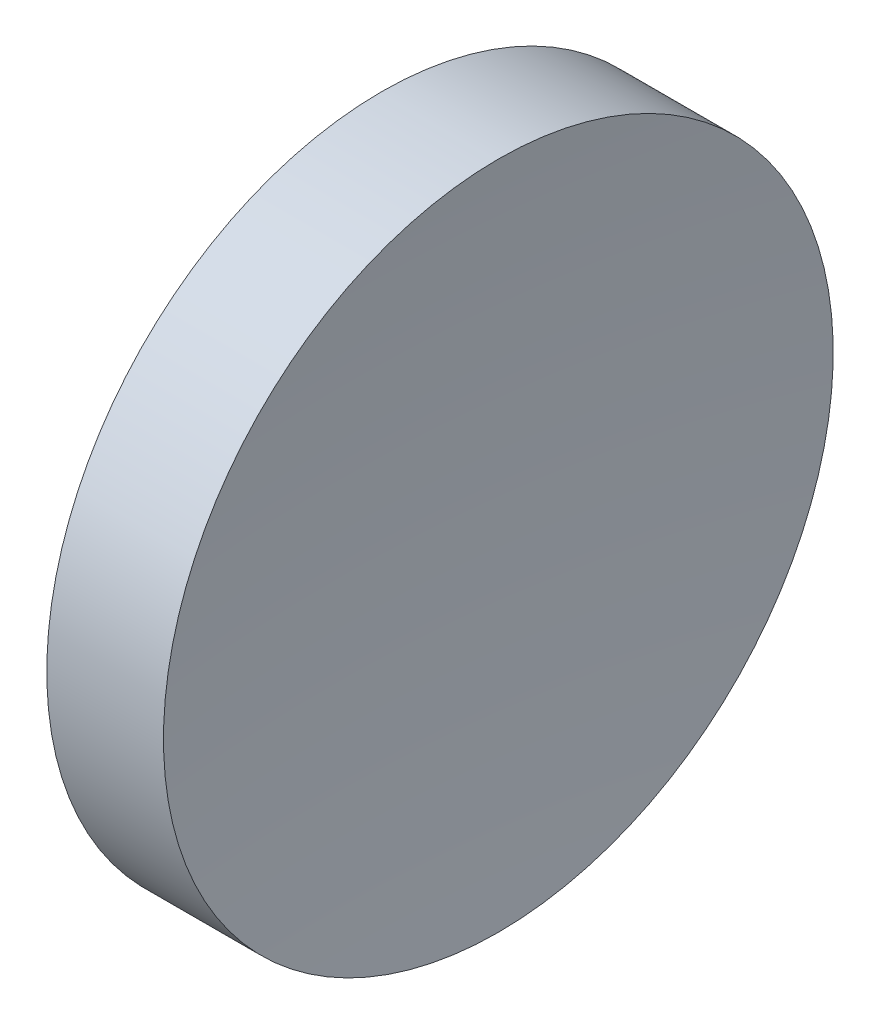
ISO-10303-21;
HEADER;
FILE_DESCRIPTION(('STEP AP214'),'2;1');
FILE_NAME('part.step','',(''),(''),'','','');
FILE_SCHEMA(('AUTOMOTIVE_DESIGN { 1 0 10303 214 1 1 1 1 }'));
ENDSEC;
DATA;
#1=APPLICATION_CONTEXT('core data for automotive mechanical design processes');
#2=APPLICATION_PROTOCOL_DEFINITION('international standard','automotive_design',2000,#1);
#3=PRODUCT_CONTEXT('',#1,'mechanical');
#4=PRODUCT('Part','Part','',(#3));
#5=PRODUCT_RELATED_PRODUCT_CATEGORY('part','',(#4));
#6=PRODUCT_DEFINITION_FORMATION('','',#4);
#7=PRODUCT_DEFINITION_CONTEXT('part definition',#1,'design');
#8=PRODUCT_DEFINITION('design','',#6,#7);
#9=PRODUCT_DEFINITION_SHAPE('','',#8);
#10=(LENGTH_UNIT() NAMED_UNIT(*) SI_UNIT(.MILLI.,.METRE.));
#11=(NAMED_UNIT(*) PLANE_ANGLE_UNIT() SI_UNIT($,.RADIAN.));
#12=(NAMED_UNIT(*) SI_UNIT($,.STERADIAN.) SOLID_ANGLE_UNIT());
#13=UNCERTAINTY_MEASURE_WITH_UNIT(LENGTH_MEASURE(1.E-05),#10,'distance_accuracy_value','');
#14=(GEOMETRIC_REPRESENTATION_CONTEXT(3) GLOBAL_UNCERTAINTY_ASSIGNED_CONTEXT((#13)) GLOBAL_UNIT_ASSIGNED_CONTEXT((#10,
#11,#12)) REPRESENTATION_CONTEXT('',''));
#15=CARTESIAN_POINT('',(0.,0.,0.));
#16=DIRECTION('',(0.,0.,1.));
#17=DIRECTION('',(1.,0.,0.));
#18=AXIS2_PLACEMENT_3D('',#15,#16,#17);
#19=CARTESIAN_POINT('',(75.5642320536207,13.031126091403,0.));
#20=DIRECTION('',(-1.,0.,0.));
#21=DIRECTION('',(0.,-1.,0.));
#22=AXIS2_PLACEMENT_3D('',#19,#20,#21);
#23=SPHERICAL_SURFACE('',#22,51.64);
#24=CARTESIAN_POINT('',(24.1668624711216,13.031126091403,0.));
#25=DIRECTION('',(-1.,0.,0.));
#26=DIRECTION('',(0.,-1.,0.));
#27=AXIS2_PLACEMENT_3D('',#24,#25,#26);
#28=CIRCLE('',#27,5.);
#29=CARTESIAN_POINT('',(24.1668624711216,8.03112609140304,0.));
#30=VERTEX_POINT('',#29);
#31=EDGE_CURVE('E10',#30,#30,#28,.T.);
#32=ORIENTED_EDGE('',*,*,#31,.F.);
#33=EDGE_LOOP('',(#32));
#34=FACE_BOUND('',#33,.T.);
#35=ADVANCED_FACE('F35',(#34),#23,.F.);
#36=CARTESIAN_POINT('',(21.5059751180825,13.031126091403,0.));
#37=DIRECTION('',(-1.,0.,0.));
#38=DIRECTION('',(0.,-1.,0.));
#39=AXIS2_PLACEMENT_3D('',#36,#37,#38);
#40=CYLINDRICAL_SURFACE('',#39,5.);
#41=CARTESIAN_POINT('',(22.4242320536207,13.031126091403,0.));
#42=DIRECTION('',(-1.,0.,0.));
#43=DIRECTION('',(0.,-1.,0.));
#44=AXIS2_PLACEMENT_3D('',#41,#42,#43);
#45=CIRCLE('',#44,5.);
#46=CARTESIAN_POINT('',(22.4242320536207,8.03112609140304,0.));
#47=VERTEX_POINT('',#46);
#48=EDGE_CURVE('E41',#47,#47,#45,.T.);
#49=ORIENTED_EDGE('',*,*,#48,.F.);
#50=EDGE_LOOP('',(#49));
#51=FACE_BOUND('',#50,.T.);
#52=ORIENTED_EDGE('',*,*,#31,.T.);
#53=EDGE_LOOP('',(#52));
#54=FACE_BOUND('',#53,.T.);
#55=ADVANCED_FACE('F49',(#51,#54),#40,.T.);
#56=CARTESIAN_POINT('',(22.4242320536207,13.031126091403,0.));
#57=DIRECTION('',(1.,0.,0.));
#58=DIRECTION('',(0.,1.,0.));
#59=AXIS2_PLACEMENT_3D('',#56,#57,#58);
#60=PLANE('',#59);
#61=ORIENTED_EDGE('',*,*,#48,.T.);
#62=EDGE_LOOP('',(#61));
#63=FACE_BOUND('',#62,.T.);
#64=ADVANCED_FACE('F47',(#63),#60,.F.);
#65=CLOSED_SHELL('',(#35,#55,#64));
#66=MANIFOLD_SOLID_BREP('B2',#65);
#67=ADVANCED_BREP_SHAPE_REPRESENTATION('',(#18,#66),#14);
#68=SHAPE_DEFINITION_REPRESENTATION(#9,#67);
ENDSEC;
END-ISO-10303-21;
